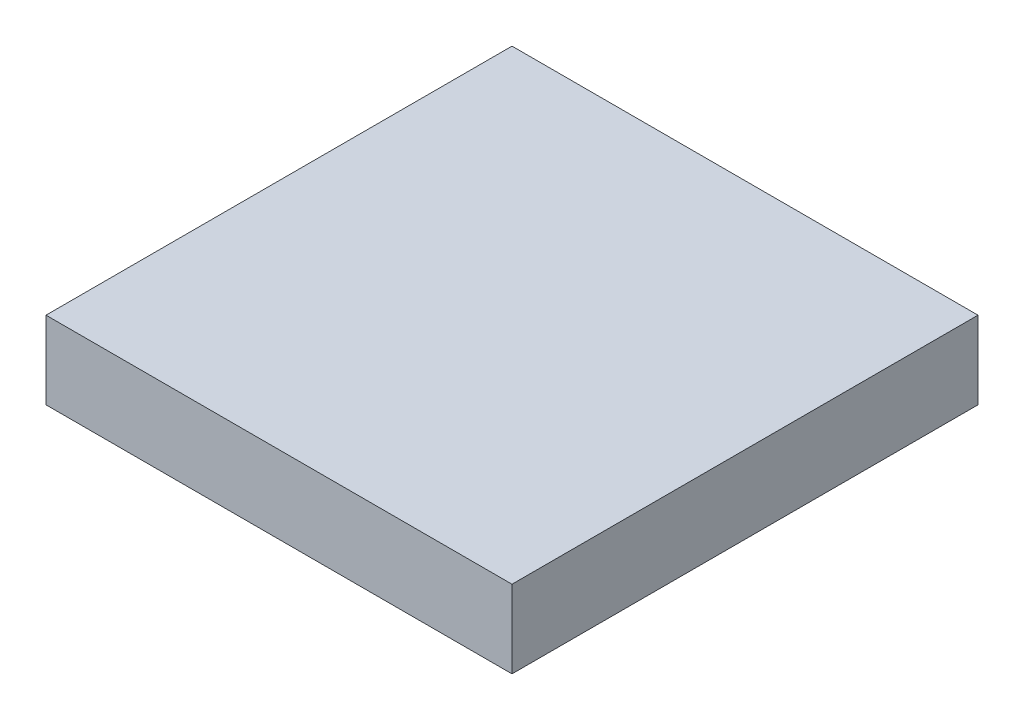
ISO-10303-21;
HEADER;
FILE_DESCRIPTION(('STEP AP214'),'2;1');
FILE_NAME('part.step','',(''),(''),'','','');
FILE_SCHEMA(('AUTOMOTIVE_DESIGN { 1 0 10303 214 1 1 1 1 }'));
ENDSEC;
DATA;
#1=APPLICATION_CONTEXT('core data for automotive mechanical design processes');
#2=APPLICATION_PROTOCOL_DEFINITION('international standard','automotive_design',2000,#1);
#3=PRODUCT_CONTEXT('',#1,'mechanical');
#4=PRODUCT('Part','Part','',(#3));
#5=PRODUCT_RELATED_PRODUCT_CATEGORY('part','',(#4));
#6=PRODUCT_DEFINITION_FORMATION('','',#4);
#7=PRODUCT_DEFINITION_CONTEXT('part definition',#1,'design');
#8=PRODUCT_DEFINITION('design','',#6,#7);
#9=PRODUCT_DEFINITION_SHAPE('','',#8);
#10=(LENGTH_UNIT() NAMED_UNIT(*) SI_UNIT(.MILLI.,.METRE.));
#11=(NAMED_UNIT(*) PLANE_ANGLE_UNIT() SI_UNIT($,.RADIAN.));
#12=(NAMED_UNIT(*) SI_UNIT($,.STERADIAN.) SOLID_ANGLE_UNIT());
#13=UNCERTAINTY_MEASURE_WITH_UNIT(LENGTH_MEASURE(1.E-05),#10,'distance_accuracy_value','');
#14=(GEOMETRIC_REPRESENTATION_CONTEXT(3) GLOBAL_UNCERTAINTY_ASSIGNED_CONTEXT((#13)) GLOBAL_UNIT_ASSIGNED_CONTEXT((#10,
#11,#12)) REPRESENTATION_CONTEXT('',''));
#15=CARTESIAN_POINT('',(0.,0.,0.));
#16=DIRECTION('',(0.,0.,1.));
#17=DIRECTION('',(1.,0.,0.));
#18=AXIS2_PLACEMENT_3D('',#15,#16,#17);
#19=CARTESIAN_POINT('',(30.,10.,-30.));
#20=DIRECTION('',(-1.,0.,0.));
#21=DIRECTION('',(0.,0.,1.));
#22=AXIS2_PLACEMENT_3D('',#19,#20,#21);
#23=PLANE('',#22);
#24=DIRECTION('',(0.,0.,-1.));
#25=VECTOR('',#24,1.);
#26=CARTESIAN_POINT('',(30.,0.,-30.));
#27=LINE('',#26,#25);
#28=CARTESIAN_POINT('',(30.,0.,30.));
#29=VERTEX_POINT('',#28);
#30=CARTESIAN_POINT('',(30.,0.,-30.));
#31=VERTEX_POINT('',#30);
#32=EDGE_CURVE('E107',#29,#31,#27,.T.);
#33=ORIENTED_EDGE('',*,*,#32,.T.);
#34=DIRECTION('',(0.,-1.,0.));
#35=VECTOR('',#34,1.);
#36=CARTESIAN_POINT('',(30.,10.,-30.));
#37=LINE('',#36,#35);
#38=CARTESIAN_POINT('',(30.,10.,-30.));
#39=VERTEX_POINT('',#38);
#40=EDGE_CURVE('E11',#39,#31,#37,.T.);
#41=ORIENTED_EDGE('',*,*,#40,.F.);
#42=DIRECTION('',(0.,0.,-1.));
#43=VECTOR('',#42,1.);
#44=CARTESIAN_POINT('',(30.,10.,-30.));
#45=LINE('',#44,#43);
#46=CARTESIAN_POINT('',(30.,10.,30.));
#47=VERTEX_POINT('',#46);
#48=EDGE_CURVE('E91',#47,#39,#45,.T.);
#49=ORIENTED_EDGE('',*,*,#48,.F.);
#50=DIRECTION('',(0.,-1.,0.));
#51=VECTOR('',#50,1.);
#52=CARTESIAN_POINT('',(30.,10.,30.));
#53=LINE('',#52,#51);
#54=EDGE_CURVE('E103',#47,#29,#53,.T.);
#55=ORIENTED_EDGE('',*,*,#54,.T.);
#56=EDGE_LOOP('',(#33,#41,#49,#55));
#57=FACE_BOUND('',#56,.T.);
#58=ADVANCED_FACE('F39',(#57),#23,.F.);
#59=CARTESIAN_POINT('',(-30.,10.,-30.));
#60=DIRECTION('',(0.,0.,1.));
#61=DIRECTION('',(1.,0.,0.));
#62=AXIS2_PLACEMENT_3D('',#59,#60,#61);
#63=PLANE('',#62);
#64=DIRECTION('',(-1.,0.,0.));
#65=VECTOR('',#64,1.);
#66=CARTESIAN_POINT('',(-30.,0.,-30.));
#67=LINE('',#66,#65);
#68=CARTESIAN_POINT('',(-30.,0.,-30.));
#69=VERTEX_POINT('',#68);
#70=EDGE_CURVE('E96',#31,#69,#67,.T.);
#71=ORIENTED_EDGE('',*,*,#70,.T.);
#72=DIRECTION('',(0.,-1.,0.));
#73=VECTOR('',#72,1.);
#74=CARTESIAN_POINT('',(-30.,10.,-30.));
#75=LINE('',#74,#73);
#76=CARTESIAN_POINT('',(-30.,10.,-30.));
#77=VERTEX_POINT('',#76);
#78=EDGE_CURVE('E48',#77,#69,#75,.T.);
#79=ORIENTED_EDGE('',*,*,#78,.F.);
#80=DIRECTION('',(-1.,0.,0.));
#81=VECTOR('',#80,1.);
#82=CARTESIAN_POINT('',(-30.,10.,-30.));
#83=LINE('',#82,#81);
#84=EDGE_CURVE('E86',#39,#77,#83,.T.);
#85=ORIENTED_EDGE('',*,*,#84,.F.);
#86=ORIENTED_EDGE('',*,*,#40,.T.);
#87=EDGE_LOOP('',(#71,#79,#85,#86));
#88=FACE_BOUND('',#87,.T.);
#89=ADVANCED_FACE('F95',(#88),#63,.F.);
#90=CARTESIAN_POINT('',(-30.,10.,-30.));
#91=DIRECTION('',(1.,0.,0.));
#92=DIRECTION('',(0.,0.,-1.));
#93=AXIS2_PLACEMENT_3D('',#90,#91,#92);
#94=PLANE('',#93);
#95=DIRECTION('',(0.,0.,1.));
#96=VECTOR('',#95,1.);
#97=CARTESIAN_POINT('',(-30.,0.,-30.));
#98=LINE('',#97,#96);
#99=CARTESIAN_POINT('',(-30.,0.,30.));
#100=VERTEX_POINT('',#99);
#101=EDGE_CURVE('E73',#69,#100,#98,.T.);
#102=ORIENTED_EDGE('',*,*,#101,.T.);
#103=DIRECTION('',(0.,-1.,0.));
#104=VECTOR('',#103,1.);
#105=CARTESIAN_POINT('',(-30.,10.,30.));
#106=LINE('',#105,#104);
#107=CARTESIAN_POINT('',(-30.,10.,30.));
#108=VERTEX_POINT('',#107);
#109=EDGE_CURVE('E98',#108,#100,#106,.T.);
#110=ORIENTED_EDGE('',*,*,#109,.F.);
#111=DIRECTION('',(0.,0.,1.));
#112=VECTOR('',#111,1.);
#113=CARTESIAN_POINT('',(-30.,10.,-30.));
#114=LINE('',#113,#112);
#115=EDGE_CURVE('E89',#77,#108,#114,.T.);
#116=ORIENTED_EDGE('',*,*,#115,.F.);
#117=ORIENTED_EDGE('',*,*,#78,.T.);
#118=EDGE_LOOP('',(#102,#110,#116,#117));
#119=FACE_BOUND('',#118,.T.);
#120=ADVANCED_FACE('F99',(#119),#94,.F.);
#121=CARTESIAN_POINT('',(-30.,10.,30.));
#122=DIRECTION('',(0.,0.,-1.));
#123=DIRECTION('',(-1.,0.,0.));
#124=AXIS2_PLACEMENT_3D('',#121,#122,#123);
#125=PLANE('',#124);
#126=DIRECTION('',(1.,0.,0.));
#127=VECTOR('',#126,1.);
#128=CARTESIAN_POINT('',(-30.,0.,30.));
#129=LINE('',#128,#127);
#130=EDGE_CURVE('E79',#100,#29,#129,.T.);
#131=ORIENTED_EDGE('',*,*,#130,.T.);
#132=ORIENTED_EDGE('',*,*,#54,.F.);
#133=DIRECTION('',(1.,0.,0.));
#134=VECTOR('',#133,1.);
#135=CARTESIAN_POINT('',(-30.,10.,30.));
#136=LINE('',#135,#134);
#137=EDGE_CURVE('E56',#108,#47,#136,.T.);
#138=ORIENTED_EDGE('',*,*,#137,.F.);
#139=ORIENTED_EDGE('',*,*,#109,.T.);
#140=EDGE_LOOP('',(#131,#132,#138,#139));
#141=FACE_BOUND('',#140,.T.);
#142=ADVANCED_FACE('F120',(#141),#125,.F.);
#143=CARTESIAN_POINT('',(0.,10.,0.));
#144=DIRECTION('',(0.,1.,0.));
#145=DIRECTION('',(0.,0.,1.));
#146=AXIS2_PLACEMENT_3D('',#143,#144,#145);
#147=PLANE('',#146);
#148=ORIENTED_EDGE('',*,*,#48,.T.);
#149=ORIENTED_EDGE('',*,*,#84,.T.);
#150=ORIENTED_EDGE('',*,*,#115,.T.);
#151=ORIENTED_EDGE('',*,*,#137,.T.);
#152=EDGE_LOOP('',(#148,#149,#150,#151));
#153=FACE_BOUND('',#152,.T.);
#154=ADVANCED_FACE('F87',(#153),#147,.T.);
#155=CARTESIAN_POINT('',(0.,0.,0.));
#156=DIRECTION('',(0.,1.,0.));
#157=DIRECTION('',(0.,0.,1.));
#158=AXIS2_PLACEMENT_3D('',#155,#156,#157);
#159=PLANE('',#158);
#160=ORIENTED_EDGE('',*,*,#32,.F.);
#161=ORIENTED_EDGE('',*,*,#130,.F.);
#162=ORIENTED_EDGE('',*,*,#101,.F.);
#163=ORIENTED_EDGE('',*,*,#70,.F.);
#164=EDGE_LOOP('',(#160,#161,#162,#163));
#165=FACE_BOUND('',#164,.T.);
#166=ADVANCED_FACE('F123',(#165),#159,.F.);
#167=CLOSED_SHELL('',(#58,#89,#120,#142,#154,#166));
#168=MANIFOLD_SOLID_BREP('B2',#167);
#169=ADVANCED_BREP_SHAPE_REPRESENTATION('',(#18,#168),#14);
#170=SHAPE_DEFINITION_REPRESENTATION(#9,#169);
ENDSEC;
END-ISO-10303-21;
